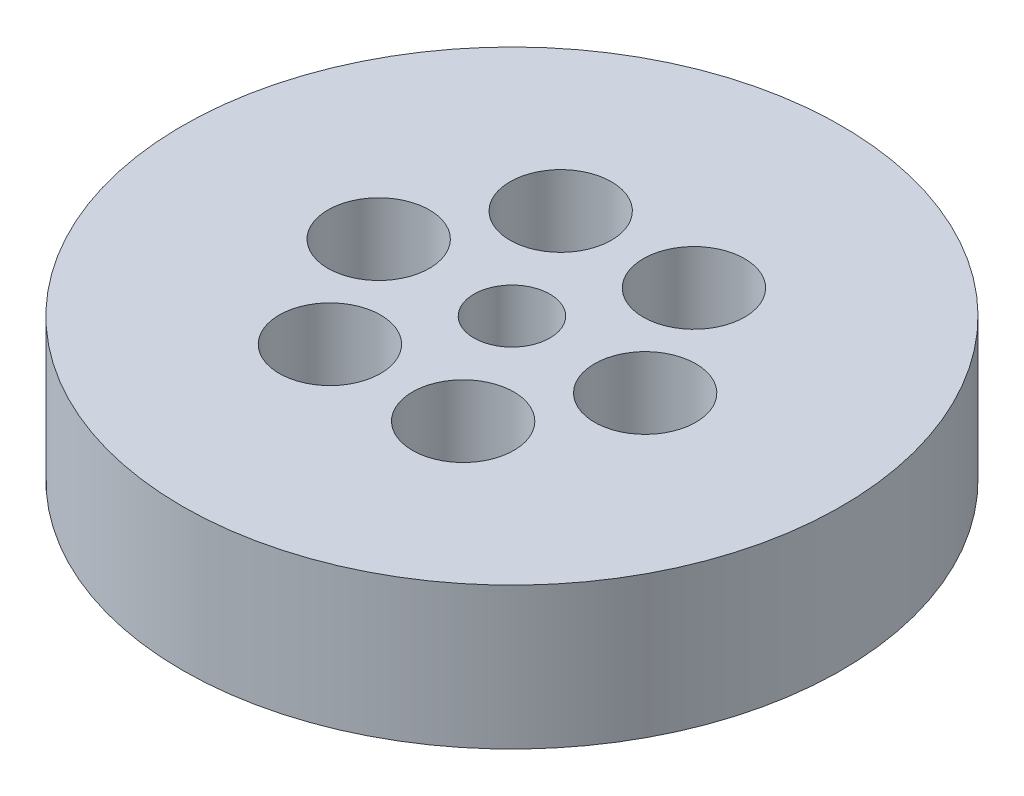
ISO-10303-21;
HEADER;
FILE_DESCRIPTION(('STEP AP214'),'2;1');
FILE_NAME('part.step','',(''),(''),'','','');
FILE_SCHEMA(('AUTOMOTIVE_DESIGN { 1 0 10303 214 1 1 1 1 }'));
ENDSEC;
DATA;
#1=APPLICATION_CONTEXT('core data for automotive mechanical design processes');
#2=APPLICATION_PROTOCOL_DEFINITION('international standard','automotive_design',2000,#1);
#3=PRODUCT_CONTEXT('',#1,'mechanical');
#4=PRODUCT('Part','Part','',(#3));
#5=PRODUCT_RELATED_PRODUCT_CATEGORY('part','',(#4));
#6=PRODUCT_DEFINITION_FORMATION('','',#4);
#7=PRODUCT_DEFINITION_CONTEXT('part definition',#1,'design');
#8=PRODUCT_DEFINITION('design','',#6,#7);
#9=PRODUCT_DEFINITION_SHAPE('','',#8);
#10=(LENGTH_UNIT() NAMED_UNIT(*) SI_UNIT(.MILLI.,.METRE.));
#11=(NAMED_UNIT(*) PLANE_ANGLE_UNIT() SI_UNIT($,.RADIAN.));
#12=(NAMED_UNIT(*) SI_UNIT($,.STERADIAN.) SOLID_ANGLE_UNIT());
#13=UNCERTAINTY_MEASURE_WITH_UNIT(LENGTH_MEASURE(1.E-05),#10,'distance_accuracy_value','');
#14=(GEOMETRIC_REPRESENTATION_CONTEXT(3) GLOBAL_UNCERTAINTY_ASSIGNED_CONTEXT((#13)) GLOBAL_UNIT_ASSIGNED_CONTEXT((#10,
#11,#12)) REPRESENTATION_CONTEXT('',''));
#15=CARTESIAN_POINT('',(0.,0.,0.));
#16=DIRECTION('',(0.,0.,1.));
#17=DIRECTION('',(1.,0.,0.));
#18=AXIS2_PLACEMENT_3D('',#15,#16,#17);
#19=CARTESIAN_POINT('',(0.,28.,0.));
#20=DIRECTION('',(0.,-1.,0.));
#21=DIRECTION('',(0.,0.,-1.));
#22=AXIS2_PLACEMENT_3D('',#19,#20,#21);
#23=CYLINDRICAL_SURFACE('',#22,65.);
#24=CARTESIAN_POINT('',(0.,28.,0.));
#25=DIRECTION('',(0.,1.,0.));
#26=DIRECTION('',(0.,0.,1.));
#27=AXIS2_PLACEMENT_3D('',#24,#25,#26);
#28=CIRCLE('',#27,65.);
#29=CARTESIAN_POINT('',(0.,28.,65.));
#30=VERTEX_POINT('',#29);
#31=EDGE_CURVE('E10',#30,#30,#28,.T.);
#32=ORIENTED_EDGE('',*,*,#31,.F.);
#33=EDGE_LOOP('',(#32));
#34=FACE_BOUND('',#33,.T.);
#35=CARTESIAN_POINT('',(0.,0.,0.));
#36=DIRECTION('',(0.,1.,0.));
#37=DIRECTION('',(0.,0.,1.));
#38=AXIS2_PLACEMENT_3D('',#35,#36,#37);
#39=CIRCLE('',#38,65.);
#40=CARTESIAN_POINT('',(0.,0.,65.));
#41=VERTEX_POINT('',#40);
#42=EDGE_CURVE('E37',#41,#41,#39,.T.);
#43=ORIENTED_EDGE('',*,*,#42,.T.);
#44=EDGE_LOOP('',(#43));
#45=FACE_BOUND('',#44,.T.);
#46=ADVANCED_FACE('F40',(#34,#45),#23,.T.);
#47=CARTESIAN_POINT('',(0.,28.,0.));
#48=DIRECTION('',(0.,1.,0.));
#49=DIRECTION('',(0.,0.,1.));
#50=AXIS2_PLACEMENT_3D('',#47,#48,#49);
#51=PLANE('',#50);
#52=CARTESIAN_POINT('',(-13.1397361662367,28.,-22.7586906379717));
#53=DIRECTION('',(0.,1.,0.));
#54=DIRECTION('',(-0.866025403784433,0.,0.50000000000001));
#55=AXIS2_PLACEMENT_3D('',#52,#53,#54);
#56=CIRCLE('',#55,10.);
#57=CARTESIAN_POINT('',(-21.799990204081,28.,-17.7586906379716));
#58=VERTEX_POINT('',#57);
#59=EDGE_CURVE('E70',#58,#58,#56,.T.);
#60=ORIENTED_EDGE('',*,*,#59,.F.);
#61=EDGE_LOOP('',(#60));
#62=FACE_BOUND('',#61,.T.);
#63=CARTESIAN_POINT('',(13.1397361662362,28.,-22.758690637972));
#64=DIRECTION('',(0.,1.,0.));
#65=DIRECTION('',(-0.866025403784443,0.,-0.499999999999992));
#66=AXIS2_PLACEMENT_3D('',#63,#64,#65);
#67=CIRCLE('',#66,10.);
#68=CARTESIAN_POINT('',(4.47948212839181,28.,-27.7586906379719));
#69=VERTEX_POINT('',#68);
#70=EDGE_CURVE('E71',#69,#69,#67,.T.);
#71=ORIENTED_EDGE('',*,*,#70,.F.);
#72=EDGE_LOOP('',(#71));
#73=FACE_BOUND('',#72,.T.);
#74=CARTESIAN_POINT('',(26.2794723324729,28.,0.));
#75=DIRECTION('',(0.,1.,0.));
#76=DIRECTION('',(0.,0.,-1.));
#77=AXIS2_PLACEMENT_3D('',#74,#75,#76);
#78=CIRCLE('',#77,10.);
#79=CARTESIAN_POINT('',(26.2794723324729,28.,-10.));
#80=VERTEX_POINT('',#79);
#81=EDGE_CURVE('E78',#80,#80,#78,.T.);
#82=ORIENTED_EDGE('',*,*,#81,.F.);
#83=EDGE_LOOP('',(#82));
#84=FACE_BOUND('',#83,.T.);
#85=CARTESIAN_POINT('',(13.1397361662366,28.,22.7586906379718));
#86=DIRECTION('',(0.,1.,0.));
#87=DIRECTION('',(0.866025403784436,0.,-0.500000000000004));
#88=AXIS2_PLACEMENT_3D('',#85,#86,#87);
#89=CIRCLE('',#88,10.);
#90=CARTESIAN_POINT('',(21.7999902040809,28.,17.7586906379717));
#91=VERTEX_POINT('',#90);
#92=EDGE_CURVE('E84',#91,#91,#89,.T.);
#93=ORIENTED_EDGE('',*,*,#92,.F.);
#94=EDGE_LOOP('',(#93));
#95=FACE_BOUND('',#94,.T.);
#96=CARTESIAN_POINT('',(-13.1397361662364,28.,22.7586906379719));
#97=DIRECTION('',(0.,1.,0.));
#98=DIRECTION('',(0.86602540378444,0.,0.499999999999998));
#99=AXIS2_PLACEMENT_3D('',#96,#97,#98);
#100=CIRCLE('',#99,10.);
#101=CARTESIAN_POINT('',(-4.47948212839201,28.,27.7586906379718));
#102=VERTEX_POINT('',#101);
#103=EDGE_CURVE('E61',#102,#102,#100,.T.);
#104=ORIENTED_EDGE('',*,*,#103,.F.);
#105=EDGE_LOOP('',(#104));
#106=FACE_BOUND('',#105,.T.);
#107=CARTESIAN_POINT('',(-26.2794723324729,28.,0.));
#108=DIRECTION('',(0.,1.,0.));
#109=DIRECTION('',(0.,0.,1.));
#110=AXIS2_PLACEMENT_3D('',#107,#108,#109);
#111=CIRCLE('',#110,10.);
#112=CARTESIAN_POINT('',(-26.2794723324729,28.,10.));
#113=VERTEX_POINT('',#112);
#114=EDGE_CURVE('E54',#113,#113,#111,.T.);
#115=ORIENTED_EDGE('',*,*,#114,.F.);
#116=EDGE_LOOP('',(#115));
#117=FACE_BOUND('',#116,.T.);
#118=CARTESIAN_POINT('',(0.,28.,0.));
#119=DIRECTION('',(0.,1.,0.));
#120=DIRECTION('',(0.,0.,1.));
#121=AXIS2_PLACEMENT_3D('',#118,#119,#120);
#122=CIRCLE('',#121,7.5);
#123=CARTESIAN_POINT('',(0.,28.,7.5));
#124=VERTEX_POINT('',#123);
#125=EDGE_CURVE('E50',#124,#124,#122,.T.);
#126=ORIENTED_EDGE('',*,*,#125,.F.);
#127=EDGE_LOOP('',(#126));
#128=FACE_BOUND('',#127,.T.);
#129=ORIENTED_EDGE('',*,*,#31,.T.);
#130=EDGE_LOOP('',(#129));
#131=FACE_BOUND('',#130,.T.);
#132=ADVANCED_FACE('F99',(#62,#73,#84,#95,#106,#117,#128,#131),#51,.T.);
#133=CARTESIAN_POINT('',(0.,0.,0.));
#134=DIRECTION('',(0.,1.,0.));
#135=DIRECTION('',(0.,0.,1.));
#136=AXIS2_PLACEMENT_3D('',#133,#134,#135);
#137=PLANE('',#136);
#138=CARTESIAN_POINT('',(0.,0.,0.));
#139=DIRECTION('',(0.,1.,0.));
#140=DIRECTION('',(0.,0.,1.));
#141=AXIS2_PLACEMENT_3D('',#138,#139,#140);
#142=CIRCLE('',#141,7.5);
#143=CARTESIAN_POINT('',(0.,0.,7.5));
#144=VERTEX_POINT('',#143);
#145=EDGE_CURVE('E47',#144,#144,#142,.T.);
#146=ORIENTED_EDGE('',*,*,#145,.T.);
#147=EDGE_LOOP('',(#146));
#148=FACE_BOUND('',#147,.T.);
#149=ORIENTED_EDGE('',*,*,#42,.F.);
#150=EDGE_LOOP('',(#149));
#151=FACE_BOUND('',#150,.T.);
#152=ADVANCED_FACE('F103',(#148,#151),#137,.F.);
#153=CARTESIAN_POINT('',(0.,28.,0.));
#154=DIRECTION('',(0.,-1.,0.));
#155=DIRECTION('',(0.,0.,-1.));
#156=AXIS2_PLACEMENT_3D('',#153,#154,#155);
#157=CYLINDRICAL_SURFACE('',#156,7.5);
#158=ORIENTED_EDGE('',*,*,#125,.T.);
#159=EDGE_LOOP('',(#158));
#160=FACE_BOUND('',#159,.T.);
#161=ORIENTED_EDGE('',*,*,#145,.F.);
#162=EDGE_LOOP('',(#161));
#163=FACE_BOUND('',#162,.T.);
#164=ADVANCED_FACE('F115',(#160,#163),#157,.F.);
#165=CARTESIAN_POINT('',(-26.2794723324729,0.51400882821389,0.));
#166=DIRECTION('',(0.,1.,0.));
#167=DIRECTION('',(0.,0.,1.));
#168=AXIS2_PLACEMENT_3D('',#165,#166,#167);
#169=CYLINDRICAL_SURFACE('',#168,10.);
#170=CARTESIAN_POINT('',(-26.2794723324729,0.51400882821389,0.));
#171=DIRECTION('',(0.,1.,0.));
#172=DIRECTION('',(0.,0.,1.));
#173=AXIS2_PLACEMENT_3D('',#170,#171,#172);
#174=CIRCLE('',#173,10.);
#175=CARTESIAN_POINT('',(-26.2794723324729,0.51400882821389,10.));
#176=VERTEX_POINT('',#175);
#177=EDGE_CURVE('E55',#176,#176,#174,.T.);
#178=ORIENTED_EDGE('',*,*,#177,.F.);
#179=EDGE_LOOP('',(#178));
#180=FACE_BOUND('',#179,.T.);
#181=ORIENTED_EDGE('',*,*,#114,.T.);
#182=EDGE_LOOP('',(#181));
#183=FACE_BOUND('',#182,.T.);
#184=ADVANCED_FACE('F113',(#180,#183),#169,.F.);
#185=CARTESIAN_POINT('',(-26.2794723324729,0.51400882821389,0.));
#186=DIRECTION('',(0.,1.,0.));
#187=DIRECTION('',(0.,0.,1.));
#188=AXIS2_PLACEMENT_3D('',#185,#186,#187);
#189=PLANE('',#188);
#190=ORIENTED_EDGE('',*,*,#177,.T.);
#191=EDGE_LOOP('',(#190));
#192=FACE_BOUND('',#191,.T.);
#193=ADVANCED_FACE('F144',(#192),#189,.T.);
#194=CARTESIAN_POINT('',(-13.1397361662364,0.51400882821389,22.7586906379719));
#195=DIRECTION('',(0.,1.,0.));
#196=DIRECTION('',(0.,0.,1.));
#197=AXIS2_PLACEMENT_3D('',#194,#195,#196);
#198=CYLINDRICAL_SURFACE('',#197,10.);
#199=CARTESIAN_POINT('',(-13.1397361662364,0.51400882821389,22.7586906379719));
#200=DIRECTION('',(0.,1.,0.));
#201=DIRECTION('',(0.86602540378444,0.,0.499999999999998));
#202=AXIS2_PLACEMENT_3D('',#199,#200,#201);
#203=CIRCLE('',#202,10.);
#204=CARTESIAN_POINT('',(-4.47948212839201,0.51400882821389,27.7586906379718));
#205=VERTEX_POINT('',#204);
#206=EDGE_CURVE('E59',#205,#205,#203,.T.);
#207=ORIENTED_EDGE('',*,*,#206,.F.);
#208=EDGE_LOOP('',(#207));
#209=FACE_BOUND('',#208,.T.);
#210=ORIENTED_EDGE('',*,*,#103,.T.);
#211=EDGE_LOOP('',(#210));
#212=FACE_BOUND('',#211,.T.);
#213=ADVANCED_FACE('F153',(#209,#212),#198,.F.);
#214=CARTESIAN_POINT('',(-13.1397361662364,0.51400882821389,22.7586906379719));
#215=DIRECTION('',(0.,1.,0.));
#216=DIRECTION('',(0.86602540378444,0.,0.499999999999998));
#217=AXIS2_PLACEMENT_3D('',#214,#215,#216);
#218=PLANE('',#217);
#219=ORIENTED_EDGE('',*,*,#206,.T.);
#220=EDGE_LOOP('',(#219));
#221=FACE_BOUND('',#220,.T.);
#222=ADVANCED_FACE('F96',(#221),#218,.T.);
#223=CARTESIAN_POINT('',(13.1397361662366,0.51400882821389,22.7586906379718));
#224=DIRECTION('',(0.,1.,0.));
#225=DIRECTION('',(0.,0.,1.));
#226=AXIS2_PLACEMENT_3D('',#223,#224,#225);
#227=CYLINDRICAL_SURFACE('',#226,10.);
#228=CARTESIAN_POINT('',(13.1397361662366,0.51400882821389,22.7586906379718));
#229=DIRECTION('',(0.,1.,0.));
#230=DIRECTION('',(0.866025403784436,0.,-0.500000000000004));
#231=AXIS2_PLACEMENT_3D('',#228,#229,#230);
#232=CIRCLE('',#231,10.);
#233=CARTESIAN_POINT('',(21.7999902040809,0.51400882821389,17.7586906379717));
#234=VERTEX_POINT('',#233);
#235=EDGE_CURVE('E63',#234,#234,#232,.T.);
#236=ORIENTED_EDGE('',*,*,#235,.F.);
#237=EDGE_LOOP('',(#236));
#238=FACE_BOUND('',#237,.T.);
#239=ORIENTED_EDGE('',*,*,#92,.T.);
#240=EDGE_LOOP('',(#239));
#241=FACE_BOUND('',#240,.T.);
#242=ADVANCED_FACE('F91',(#238,#241),#227,.F.);
#243=CARTESIAN_POINT('',(13.1397361662366,0.51400882821389,22.7586906379718));
#244=DIRECTION('',(0.,1.,0.));
#245=DIRECTION('',(0.866025403784436,0.,-0.500000000000004));
#246=AXIS2_PLACEMENT_3D('',#243,#244,#245);
#247=PLANE('',#246);
#248=ORIENTED_EDGE('',*,*,#235,.T.);
#249=EDGE_LOOP('',(#248));
#250=FACE_BOUND('',#249,.T.);
#251=ADVANCED_FACE('F93',(#250),#247,.T.);
#252=CARTESIAN_POINT('',(26.2794723324729,0.51400882821389,0.));
#253=DIRECTION('',(0.,1.,0.));
#254=DIRECTION('',(0.,0.,1.));
#255=AXIS2_PLACEMENT_3D('',#252,#253,#254);
#256=CYLINDRICAL_SURFACE('',#255,10.);
#257=CARTESIAN_POINT('',(26.2794723324729,0.51400882821389,0.));
#258=DIRECTION('',(0.,1.,0.));
#259=DIRECTION('',(0.,0.,-1.));
#260=AXIS2_PLACEMENT_3D('',#257,#258,#259);
#261=CIRCLE('',#260,10.);
#262=CARTESIAN_POINT('',(26.2794723324729,0.51400882821389,-10.));
#263=VERTEX_POINT('',#262);
#264=EDGE_CURVE('E85',#263,#263,#261,.T.);
#265=ORIENTED_EDGE('',*,*,#264,.F.);
#266=EDGE_LOOP('',(#265));
#267=FACE_BOUND('',#266,.T.);
#268=ORIENTED_EDGE('',*,*,#81,.T.);
#269=EDGE_LOOP('',(#268));
#270=FACE_BOUND('',#269,.T.);
#271=ADVANCED_FACE('F187',(#267,#270),#256,.F.);
#272=CARTESIAN_POINT('',(26.2794723324729,0.51400882821389,0.));
#273=DIRECTION('',(0.,1.,0.));
#274=DIRECTION('',(0.,0.,-1.));
#275=AXIS2_PLACEMENT_3D('',#272,#273,#274);
#276=PLANE('',#275);
#277=ORIENTED_EDGE('',*,*,#264,.T.);
#278=EDGE_LOOP('',(#277));
#279=FACE_BOUND('',#278,.T.);
#280=ADVANCED_FACE('F198',(#279),#276,.T.);
#281=CARTESIAN_POINT('',(13.1397361662362,0.51400882821389,-22.758690637972));
#282=DIRECTION('',(0.,1.,0.));
#283=DIRECTION('',(0.,0.,1.));
#284=AXIS2_PLACEMENT_3D('',#281,#282,#283);
#285=CYLINDRICAL_SURFACE('',#284,10.);
#286=CARTESIAN_POINT('',(13.1397361662362,0.51400882821389,-22.758690637972));
#287=DIRECTION('',(0.,1.,0.));
#288=DIRECTION('',(-0.866025403784443,0.,-0.499999999999992));
#289=AXIS2_PLACEMENT_3D('',#286,#287,#288);
#290=CIRCLE('',#289,10.);
#291=CARTESIAN_POINT('',(4.47948212839181,0.51400882821389,-27.7586906379719));
#292=VERTEX_POINT('',#291);
#293=EDGE_CURVE('E76',#292,#292,#290,.T.);
#294=ORIENTED_EDGE('',*,*,#293,.F.);
#295=EDGE_LOOP('',(#294));
#296=FACE_BOUND('',#295,.T.);
#297=ORIENTED_EDGE('',*,*,#70,.T.);
#298=EDGE_LOOP('',(#297));
#299=FACE_BOUND('',#298,.T.);
#300=ADVANCED_FACE('F202',(#296,#299),#285,.F.);
#301=CARTESIAN_POINT('',(13.1397361662362,0.51400882821389,-22.758690637972));
#302=DIRECTION('',(0.,1.,0.));
#303=DIRECTION('',(-0.866025403784443,0.,-0.499999999999992));
#304=AXIS2_PLACEMENT_3D('',#301,#302,#303);
#305=PLANE('',#304);
#306=ORIENTED_EDGE('',*,*,#293,.T.);
#307=EDGE_LOOP('',(#306));
#308=FACE_BOUND('',#307,.T.);
#309=ADVANCED_FACE('F212',(#308),#305,.T.);
#310=CARTESIAN_POINT('',(-13.1397361662367,0.51400882821389,-22.7586906379717));
#311=DIRECTION('',(0.,1.,0.));
#312=DIRECTION('',(0.,0.,1.));
#313=AXIS2_PLACEMENT_3D('',#310,#311,#312);
#314=CYLINDRICAL_SURFACE('',#313,10.);
#315=CARTESIAN_POINT('',(-13.1397361662367,0.51400882821389,-22.7586906379717));
#316=DIRECTION('',(0.,1.,0.));
#317=DIRECTION('',(-0.866025403784433,0.,0.50000000000001));
#318=AXIS2_PLACEMENT_3D('',#315,#316,#317);
#319=CIRCLE('',#318,10.);
#320=CARTESIAN_POINT('',(-21.799990204081,0.51400882821389,-17.7586906379716));
#321=VERTEX_POINT('',#320);
#322=EDGE_CURVE('E69',#321,#321,#319,.T.);
#323=ORIENTED_EDGE('',*,*,#322,.F.);
#324=EDGE_LOOP('',(#323));
#325=FACE_BOUND('',#324,.T.);
#326=ORIENTED_EDGE('',*,*,#59,.T.);
#327=EDGE_LOOP('',(#326));
#328=FACE_BOUND('',#327,.T.);
#329=ADVANCED_FACE('F224',(#325,#328),#314,.F.);
#330=CARTESIAN_POINT('',(-13.1397361662367,0.51400882821389,-22.7586906379717));
#331=DIRECTION('',(0.,1.,0.));
#332=DIRECTION('',(-0.866025403784433,0.,0.50000000000001));
#333=AXIS2_PLACEMENT_3D('',#330,#331,#332);
#334=PLANE('',#333);
#335=ORIENTED_EDGE('',*,*,#322,.T.);
#336=EDGE_LOOP('',(#335));
#337=FACE_BOUND('',#336,.T.);
#338=ADVANCED_FACE('F235',(#337),#334,.T.);
#339=CLOSED_SHELL('',(#46,#132,#152,#164,#184,#193,#213,#222,#242,#251,#271,#280,#300,#309,#329,#338));
#340=MANIFOLD_SOLID_BREP('B2',#339);
#341=ADVANCED_BREP_SHAPE_REPRESENTATION('',(#18,#340),#14);
#342=SHAPE_DEFINITION_REPRESENTATION(#9,#341);
ENDSEC;
END-ISO-10303-21;
